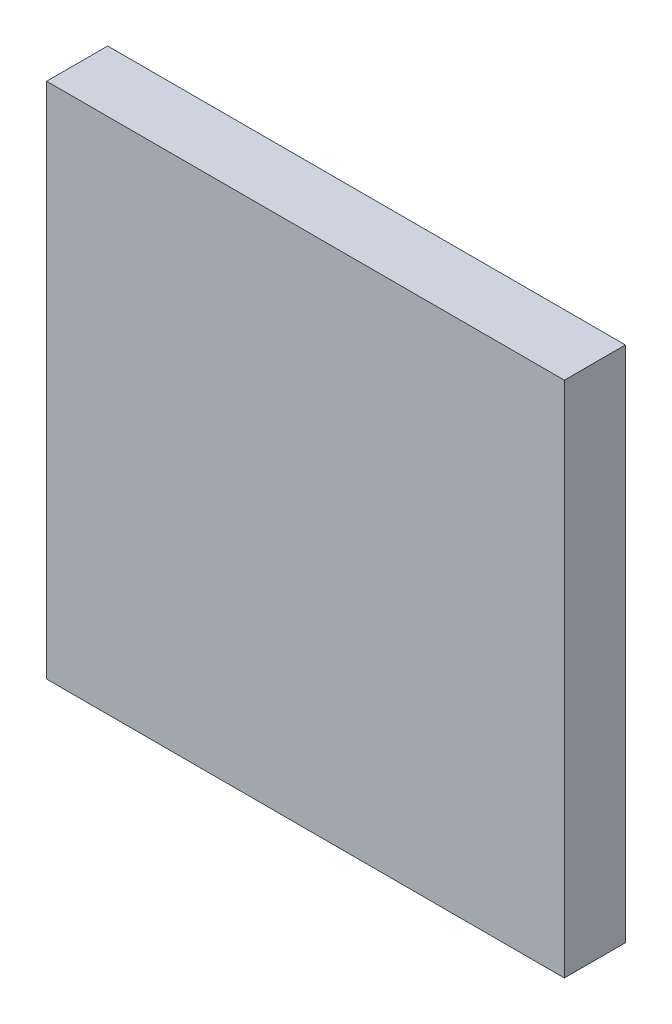
ISO-10303-21;
HEADER;
FILE_DESCRIPTION(('STEP AP214'),'2;1');
FILE_NAME('part.step','',(''),(''),'','','');
FILE_SCHEMA(('AUTOMOTIVE_DESIGN { 1 0 10303 214 1 1 1 1 }'));
ENDSEC;
DATA;
#1=APPLICATION_CONTEXT('core data for automotive mechanical design processes');
#2=APPLICATION_PROTOCOL_DEFINITION('international standard','automotive_design',2000,#1);
#3=PRODUCT_CONTEXT('',#1,'mechanical');
#4=PRODUCT('Part','Part','',(#3));
#5=PRODUCT_RELATED_PRODUCT_CATEGORY('part','',(#4));
#6=PRODUCT_DEFINITION_FORMATION('','',#4);
#7=PRODUCT_DEFINITION_CONTEXT('part definition',#1,'design');
#8=PRODUCT_DEFINITION('design','',#6,#7);
#9=PRODUCT_DEFINITION_SHAPE('','',#8);
#10=(LENGTH_UNIT() NAMED_UNIT(*) SI_UNIT(.MILLI.,.METRE.));
#11=(NAMED_UNIT(*) PLANE_ANGLE_UNIT() SI_UNIT($,.RADIAN.));
#12=(NAMED_UNIT(*) SI_UNIT($,.STERADIAN.) SOLID_ANGLE_UNIT());
#13=UNCERTAINTY_MEASURE_WITH_UNIT(LENGTH_MEASURE(1.E-05),#10,'distance_accuracy_value','');
#14=(GEOMETRIC_REPRESENTATION_CONTEXT(3) GLOBAL_UNCERTAINTY_ASSIGNED_CONTEXT((#13)) GLOBAL_UNIT_ASSIGNED_CONTEXT((#10,
#11,#12)) REPRESENTATION_CONTEXT('',''));
#15=CARTESIAN_POINT('',(0.,0.,0.));
#16=DIRECTION('',(0.,0.,1.));
#17=DIRECTION('',(1.,0.,0.));
#18=AXIS2_PLACEMENT_3D('',#15,#16,#17);
#19=CARTESIAN_POINT('',(0.359731676890786,-12.3662846645274,44.21209652793));
#20=DIRECTION('',(0.,1.,0.));
#21=DIRECTION('',(0.,0.,1.));
#22=AXIS2_PLACEMENT_3D('',#19,#20,#21);
#23=PLANE('',#22);
#24=DIRECTION('',(0.,0.,-1.));
#25=VECTOR('',#24,1.);
#26=CARTESIAN_POINT('',(0.359731676890786,-12.3662846645274,44.21209652793));
#27=LINE('',#26,#25);
#28=CARTESIAN_POINT('',(0.359731676890786,-12.3662846645274,44.21209652793));
#29=VERTEX_POINT('',#28);
#30=CARTESIAN_POINT('',(0.359731676890786,-12.3662846645274,43.6520965279299));
#31=VERTEX_POINT('',#30);
#32=EDGE_CURVE('E56',#29,#31,#27,.T.);
#33=ORIENTED_EDGE('',*,*,#32,.F.);
#34=DIRECTION('',(-1.,0.,0.));
#35=VECTOR('',#34,1.);
#36=CARTESIAN_POINT('',(0.359731676890786,-12.3662846645274,44.21209652793));
#37=LINE('',#36,#35);
#38=CARTESIAN_POINT('',(-4.39026832310921,-12.3662846645274,44.21209652793));
#39=VERTEX_POINT('',#38);
#40=EDGE_CURVE('E83',#29,#39,#37,.T.);
#41=ORIENTED_EDGE('',*,*,#40,.T.);
#42=DIRECTION('',(0.,0.,-1.));
#43=VECTOR('',#42,1.);
#44=CARTESIAN_POINT('',(-4.39026832310921,-12.3662846645274,44.21209652793));
#45=LINE('',#44,#43);
#46=CARTESIAN_POINT('',(-4.39026832310921,-12.3662846645274,43.6520965279299));
#47=VERTEX_POINT('',#46);
#48=EDGE_CURVE('E36',#39,#47,#45,.T.);
#49=ORIENTED_EDGE('',*,*,#48,.T.);
#50=DIRECTION('',(1.,0.,0.));
#51=VECTOR('',#50,1.);
#52=CARTESIAN_POINT('',(0.359731676890786,-12.3662846645274,43.6520965279299));
#53=LINE('',#52,#51);
#54=EDGE_CURVE('E41',#47,#31,#53,.T.);
#55=ORIENTED_EDGE('',*,*,#54,.T.);
#56=EDGE_LOOP('',(#33,#41,#49,#55));
#57=FACE_BOUND('',#56,.T.);
#58=ADVANCED_FACE('F32',(#57),#23,.F.);
#59=CARTESIAN_POINT('',(0.,0.,44.21209652793));
#60=DIRECTION('',(0.,0.,1.));
#61=DIRECTION('',(1.,0.,0.));
#62=AXIS2_PLACEMENT_3D('',#59,#60,#61);
#63=PLANE('',#62);
#64=DIRECTION('',(0.,1.,0.));
#65=VECTOR('',#64,1.);
#66=CARTESIAN_POINT('',(0.359731676890786,-12.3662846645274,44.21209652793));
#67=LINE('',#66,#65);
#68=CARTESIAN_POINT('',(0.359731676890786,-7.61628466452741,44.21209652793));
#69=VERTEX_POINT('',#68);
#70=EDGE_CURVE('E93',#29,#69,#67,.T.);
#71=ORIENTED_EDGE('',*,*,#70,.T.);
#72=DIRECTION('',(1.,0.,0.));
#73=VECTOR('',#72,1.);
#74=CARTESIAN_POINT('',(-4.39026832310921,-7.61628466452742,44.21209652793));
#75=LINE('',#74,#73);
#76=CARTESIAN_POINT('',(-4.39026832310921,-7.61628466452742,44.21209652793));
#77=VERTEX_POINT('',#76);
#78=EDGE_CURVE('E78',#77,#69,#75,.T.);
#79=ORIENTED_EDGE('',*,*,#78,.F.);
#80=DIRECTION('',(0.,1.,0.));
#81=VECTOR('',#80,1.);
#82=CARTESIAN_POINT('',(-4.39026832310921,-12.3662846645274,44.21209652793));
#83=LINE('',#82,#81);
#84=EDGE_CURVE('E76',#39,#77,#83,.T.);
#85=ORIENTED_EDGE('',*,*,#84,.F.);
#86=ORIENTED_EDGE('',*,*,#40,.F.);
#87=EDGE_LOOP('',(#71,#79,#85,#86));
#88=FACE_BOUND('',#87,.T.);
#89=ADVANCED_FACE('F82',(#88),#63,.T.);
#90=CARTESIAN_POINT('',(0.,0.,43.6520965279299));
#91=DIRECTION('',(0.,0.,1.));
#92=DIRECTION('',(1.,0.,0.));
#93=AXIS2_PLACEMENT_3D('',#90,#91,#92);
#94=PLANE('',#93);
#95=DIRECTION('',(0.,-1.,0.));
#96=VECTOR('',#95,1.);
#97=CARTESIAN_POINT('',(-4.39026832310921,-12.3662846645274,43.6520965279299));
#98=LINE('',#97,#96);
#99=CARTESIAN_POINT('',(-4.39026832310921,-7.61628466452742,43.6520965279299));
#100=VERTEX_POINT('',#99);
#101=EDGE_CURVE('E11',#100,#47,#98,.T.);
#102=ORIENTED_EDGE('',*,*,#101,.F.);
#103=DIRECTION('',(-1.,0.,0.));
#104=VECTOR('',#103,1.);
#105=CARTESIAN_POINT('',(0.359731676890786,-7.61628466452741,43.6520965279299));
#106=LINE('',#105,#104);
#107=CARTESIAN_POINT('',(0.359731676890786,-7.61628466452741,43.6520965279299));
#108=VERTEX_POINT('',#107);
#109=EDGE_CURVE('E89',#108,#100,#106,.T.);
#110=ORIENTED_EDGE('',*,*,#109,.F.);
#111=DIRECTION('',(0.,1.,0.));
#112=VECTOR('',#111,1.);
#113=CARTESIAN_POINT('',(0.359731676890786,-12.3662846645274,43.6520965279299));
#114=LINE('',#113,#112);
#115=EDGE_CURVE('E92',#31,#108,#114,.T.);
#116=ORIENTED_EDGE('',*,*,#115,.F.);
#117=ORIENTED_EDGE('',*,*,#54,.F.);
#118=EDGE_LOOP('',(#102,#110,#116,#117));
#119=FACE_BOUND('',#118,.T.);
#120=ADVANCED_FACE('F106',(#119),#94,.F.);
#121=CARTESIAN_POINT('',(0.359731676890786,-12.3662846645274,44.21209652793));
#122=DIRECTION('',(-1.,0.,0.));
#123=DIRECTION('',(0.,0.,1.));
#124=AXIS2_PLACEMENT_3D('',#121,#122,#123);
#125=PLANE('',#124);
#126=ORIENTED_EDGE('',*,*,#70,.F.);
#127=ORIENTED_EDGE('',*,*,#32,.T.);
#128=ORIENTED_EDGE('',*,*,#115,.T.);
#129=DIRECTION('',(0.,0.,-1.));
#130=VECTOR('',#129,1.);
#131=CARTESIAN_POINT('',(0.359731676890786,-7.61628466452741,44.21209652793));
#132=LINE('',#131,#130);
#133=EDGE_CURVE('E99',#69,#108,#132,.T.);
#134=ORIENTED_EDGE('',*,*,#133,.F.);
#135=EDGE_LOOP('',(#126,#127,#128,#134));
#136=FACE_BOUND('',#135,.T.);
#137=ADVANCED_FACE('F104',(#136),#125,.F.);
#138=CARTESIAN_POINT('',(-4.39026832310921,-12.3662846645274,44.21209652793));
#139=DIRECTION('',(1.,0.,0.));
#140=DIRECTION('',(0.,0.,-1.));
#141=AXIS2_PLACEMENT_3D('',#138,#139,#140);
#142=PLANE('',#141);
#143=ORIENTED_EDGE('',*,*,#48,.F.);
#144=ORIENTED_EDGE('',*,*,#84,.T.);
#145=DIRECTION('',(0.,0.,-1.));
#146=VECTOR('',#145,1.);
#147=CARTESIAN_POINT('',(-4.39026832310921,-7.61628466452742,44.21209652793));
#148=LINE('',#147,#146);
#149=EDGE_CURVE('E97',#77,#100,#148,.T.);
#150=ORIENTED_EDGE('',*,*,#149,.T.);
#151=ORIENTED_EDGE('',*,*,#101,.T.);
#152=EDGE_LOOP('',(#143,#144,#150,#151));
#153=FACE_BOUND('',#152,.T.);
#154=ADVANCED_FACE('F75',(#153),#142,.F.);
#155=CARTESIAN_POINT('',(0.359731676890786,-7.61628466452741,44.21209652793));
#156=DIRECTION('',(0.,-1.,0.));
#157=DIRECTION('',(1.,0.,0.));
#158=AXIS2_PLACEMENT_3D('',#155,#156,#157);
#159=PLANE('',#158);
#160=ORIENTED_EDGE('',*,*,#149,.F.);
#161=ORIENTED_EDGE('',*,*,#78,.T.);
#162=ORIENTED_EDGE('',*,*,#133,.T.);
#163=ORIENTED_EDGE('',*,*,#109,.T.);
#164=EDGE_LOOP('',(#160,#161,#162,#163));
#165=FACE_BOUND('',#164,.T.);
#166=ADVANCED_FACE('F34',(#165),#159,.F.);
#167=CLOSED_SHELL('',(#58,#89,#120,#137,#154,#166));
#168=MANIFOLD_SOLID_BREP('B2',#167);
#169=ADVANCED_BREP_SHAPE_REPRESENTATION('',(#18,#168),#14);
#170=SHAPE_DEFINITION_REPRESENTATION(#9,#169);
ENDSEC;
END-ISO-10303-21;
